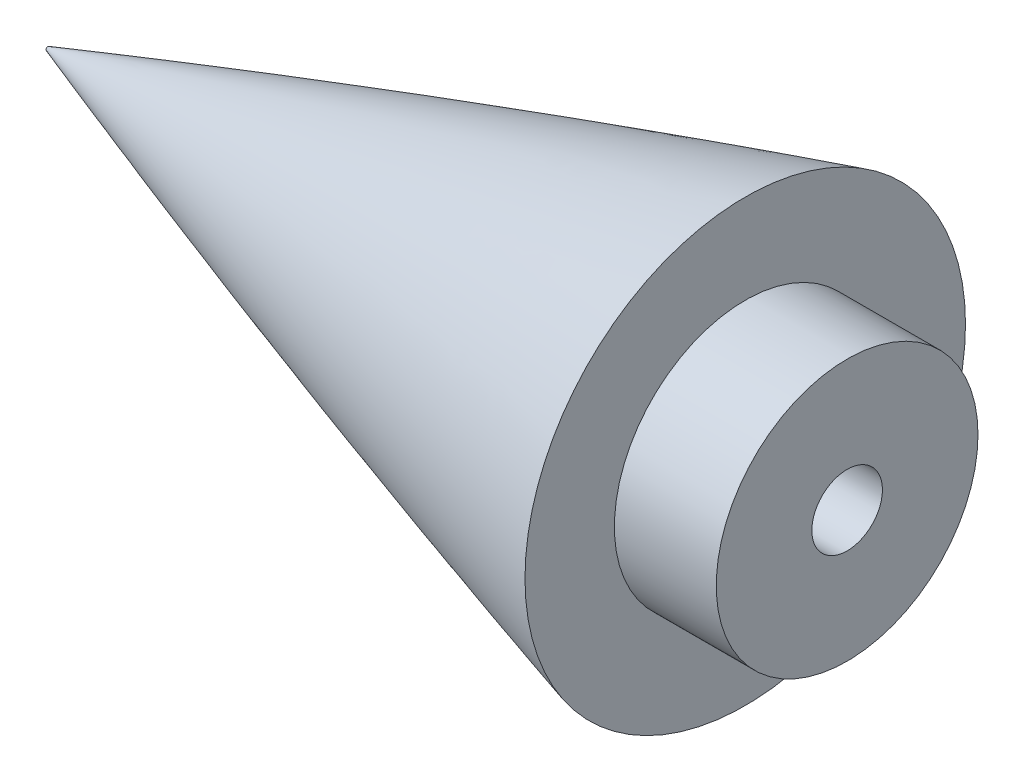
ISO-10303-21;
HEADER;
FILE_DESCRIPTION(('STEP AP214'),'2;1');
FILE_NAME('part.step','',(''),(''),'','','');
FILE_SCHEMA(('AUTOMOTIVE_DESIGN { 1 0 10303 214 1 1 1 1 }'));
ENDSEC;
DATA;
#1=APPLICATION_CONTEXT('core data for automotive mechanical design processes');
#2=APPLICATION_PROTOCOL_DEFINITION('international standard','automotive_design',2000,#1);
#3=PRODUCT_CONTEXT('',#1,'mechanical');
#4=PRODUCT('Part','Part','',(#3));
#5=PRODUCT_RELATED_PRODUCT_CATEGORY('part','',(#4));
#6=PRODUCT_DEFINITION_FORMATION('','',#4);
#7=PRODUCT_DEFINITION_CONTEXT('part definition',#1,'design');
#8=PRODUCT_DEFINITION('design','',#6,#7);
#9=PRODUCT_DEFINITION_SHAPE('','',#8);
#10=(LENGTH_UNIT() NAMED_UNIT(*) SI_UNIT(.MILLI.,.METRE.));
#11=(NAMED_UNIT(*) PLANE_ANGLE_UNIT() SI_UNIT($,.RADIAN.));
#12=(NAMED_UNIT(*) SI_UNIT($,.STERADIAN.) SOLID_ANGLE_UNIT());
#13=UNCERTAINTY_MEASURE_WITH_UNIT(LENGTH_MEASURE(1.E-05),#10,'distance_accuracy_value','');
#14=(GEOMETRIC_REPRESENTATION_CONTEXT(3) GLOBAL_UNCERTAINTY_ASSIGNED_CONTEXT((#13)) GLOBAL_UNIT_ASSIGNED_CONTEXT((#10,
#11,#12)) REPRESENTATION_CONTEXT('',''));
#15=CARTESIAN_POINT('',(0.,0.,0.));
#16=DIRECTION('',(0.,0.,1.));
#17=DIRECTION('',(1.,0.,0.));
#18=AXIS2_PLACEMENT_3D('',#15,#16,#17);
#19=CARTESIAN_POINT('',(304.799999999506,51.1047878336266,0.));
#20=CARTESIAN_POINT('',(270.933333332893,51.1047771241226,0.));
#21=CARTESIAN_POINT('',(237.06666666628,49.7240274145074,0.));
#22=CARTESIAN_POINT('',(203.199999999667,46.9624932596343,0.));
#23=CARTESIAN_POINT('',(169.333333333054,42.8097292504862,0.));
#24=CARTESIAN_POINT('',(135.46666666644,37.2447037749165,0.));
#25=CARTESIAN_POINT('',(101.599999999826,30.2351540671539,0.));
#26=CARTESIAN_POINT('',(67.7333333332116,21.7356981956307,0.));
#27=CARTESIAN_POINT('',(33.8666666665968,11.6851113039398,0.));
#28=CARTESIAN_POINT('',(-1.84184265061837E-11,-6.35667733728251E-12,0.));
#29=B_SPLINE_CURVE_WITH_KNOTS('',9,(#19,#20,#21,#22,#23,#24,#25,#26,#27,#28),.UNSPECIFIED.,.F.,
.F.,(10,10),(0.0799286240830465,0.916357147641747),.UNSPECIFIED.);
#30=CARTESIAN_POINT('',(0.,0.,0.));
#31=DIRECTION('',(-1.,0.,0.));
#32=AXIS1_PLACEMENT('',#30,#31);
#33=SURFACE_OF_REVOLUTION('',#29,#32);
#34=CARTESIAN_POINT('',(50.8,0.,0.));
#35=DIRECTION('',(-1.,0.,0.));
#36=DIRECTION('',(0.,0.,1.));
#37=AXIS2_PLACEMENT_3D('',#34,#35,#36);
#38=CIRCLE('',#37,15.9235143856326);
#39=CARTESIAN_POINT('',(50.8,0.,15.9235143856326));
#40=VERTEX_POINT('',#39);
#41=EDGE_CURVE('E53',#40,#40,#38,.T.);
#42=ORIENTED_EDGE('',*,*,#41,.T.);
#43=EDGE_LOOP('',(#42));
#44=FACE_BOUND('',#43,.T.);
#45=CARTESIAN_POINT('',(0.380999999999996,0.,0.));
#46=DIRECTION('',(-1.,0.,0.));
#47=DIRECTION('',(0.,0.,1.));
#48=AXIS2_PLACEMENT_3D('',#45,#46,#47);
#49=CIRCLE('',#48,0.131365573846303);
#50=CARTESIAN_POINT('',(0.380999999999996,0.,0.131365573846303));
#51=VERTEX_POINT('',#50);
#52=EDGE_CURVE('E78',#51,#51,#49,.F.);
#53=ORIENTED_EDGE('',*,*,#52,.T.);
#54=EDGE_LOOP('',(#53));
#55=FACE_BOUND('',#54,.T.);
#56=ADVANCED_FACE('F49',(#44,#55),#33,.T.);
#57=CARTESIAN_POINT('',(0.381,2.75984382523113,-51.1047878336267));
#58=DIRECTION('',(1.,0.,0.));
#59=DIRECTION('',(0.,1.,0.));
#60=AXIS2_PLACEMENT_3D('',#57,#58,#59);
#61=PLANE('',#60);
#62=ORIENTED_EDGE('',*,*,#52,.F.);
#63=EDGE_LOOP('',(#62));
#64=FACE_BOUND('',#63,.T.);
#65=ADVANCED_FACE('F100',(#64),#61,.F.);
#66=CARTESIAN_POINT('',(50.8,-63.5,-51.1047878336267));
#67=DIRECTION('',(-1.,0.,0.));
#68=DIRECTION('',(0.,0.,1.));
#69=AXIS2_PLACEMENT_3D('',#66,#67,#68);
#70=PLANE('',#69);
#71=CARTESIAN_POINT('',(50.8,0.,0.));
#72=DIRECTION('',(1.,0.,0.));
#73=DIRECTION('',(0.,0.,-1.));
#74=AXIS2_PLACEMENT_3D('',#71,#72,#73);
#75=CIRCLE('',#74,9.4615);
#76=CARTESIAN_POINT('',(50.8,0.,-9.4615));
#77=VERTEX_POINT('',#76);
#78=EDGE_CURVE('E11',#77,#77,#75,.T.);
#79=ORIENTED_EDGE('',*,*,#78,.F.);
#80=EDGE_LOOP('',(#79));
#81=FACE_BOUND('',#80,.T.);
#82=ORIENTED_EDGE('',*,*,#41,.F.);
#83=EDGE_LOOP('',(#82));
#84=FACE_BOUND('',#83,.T.);
#85=ADVANCED_FACE('F97',(#81,#84),#70,.F.);
#86=CARTESIAN_POINT('',(58.166,0.,0.));
#87=DIRECTION('',(-1.,0.,0.));
#88=DIRECTION('',(0.,0.,1.));
#89=AXIS2_PLACEMENT_3D('',#86,#87,#88);
#90=CYLINDRICAL_SURFACE('',#89,9.4615);
#91=CARTESIAN_POINT('',(58.166,0.,0.));
#92=DIRECTION('',(1.,0.,0.));
#93=DIRECTION('',(0.,0.,-1.));
#94=AXIS2_PLACEMENT_3D('',#91,#92,#93);
#95=CIRCLE('',#94,9.4615);
#96=CARTESIAN_POINT('',(58.166,0.,-9.4615));
#97=VERTEX_POINT('',#96);
#98=EDGE_CURVE('E72',#97,#97,#95,.T.);
#99=ORIENTED_EDGE('',*,*,#98,.F.);
#100=EDGE_LOOP('',(#99));
#101=FACE_BOUND('',#100,.T.);
#102=ORIENTED_EDGE('',*,*,#78,.T.);
#103=EDGE_LOOP('',(#102));
#104=FACE_BOUND('',#103,.T.);
#105=ADVANCED_FACE('F99',(#101,#104),#90,.T.);
#106=CARTESIAN_POINT('',(58.166,0.,0.));
#107=DIRECTION('',(1.,0.,0.));
#108=DIRECTION('',(0.,0.,-1.));
#109=AXIS2_PLACEMENT_3D('',#106,#107,#108);
#110=PLANE('',#109);
#111=CARTESIAN_POINT('',(58.166,0.,0.));
#112=DIRECTION('',(1.,0.,0.));
#113=DIRECTION('',(0.,0.,-1.));
#114=AXIS2_PLACEMENT_3D('',#111,#112,#113);
#115=CIRCLE('',#114,2.55269999999999);
#116=CARTESIAN_POINT('',(58.166,0.,-2.55269999999999));
#117=VERTEX_POINT('',#116);
#118=EDGE_CURVE('E73',#117,#117,#115,.T.);
#119=ORIENTED_EDGE('',*,*,#118,.F.);
#120=EDGE_LOOP('',(#119));
#121=FACE_BOUND('',#120,.T.);
#122=ORIENTED_EDGE('',*,*,#98,.T.);
#123=EDGE_LOOP('',(#122));
#124=FACE_BOUND('',#123,.T.);
#125=ADVANCED_FACE('F65',(#121,#124),#110,.T.);
#126=CARTESIAN_POINT('',(32.766,0.,0.));
#127=DIRECTION('',(1.,0.,0.));
#128=DIRECTION('',(0.,0.,-1.));
#129=AXIS2_PLACEMENT_3D('',#126,#127,#128);
#130=CONICAL_SURFACE('',#129,2.55269999999999,1.02974425867665);
#131=CARTESIAN_POINT('',(31.2321830978083,0.,0.));
#132=VERTEX_POINT('',#131);
#133=VERTEX_LOOP('',#132);
#134=FACE_BOUND('',#133,.T.);
#135=CARTESIAN_POINT('',(32.766,0.,0.));
#136=DIRECTION('',(1.,0.,0.));
#137=DIRECTION('',(0.,0.,-1.));
#138=AXIS2_PLACEMENT_3D('',#135,#136,#137);
#139=CIRCLE('',#138,2.55269999999999);
#140=CARTESIAN_POINT('',(32.766,0.,-2.55269999999999));
#141=VERTEX_POINT('',#140);
#142=EDGE_CURVE('E69',#141,#141,#139,.T.);
#143=ORIENTED_EDGE('',*,*,#142,.T.);
#144=EDGE_LOOP('',(#143));
#145=FACE_BOUND('',#144,.T.);
#146=ADVANCED_FACE('F61',(#134,#145),#130,.F.);
#147=CARTESIAN_POINT('',(58.166,0.,0.));
#148=DIRECTION('',(1.,0.,0.));
#149=DIRECTION('',(0.,0.,-1.));
#150=AXIS2_PLACEMENT_3D('',#147,#148,#149);
#151=CYLINDRICAL_SURFACE('',#150,2.55269999999999);
#152=ORIENTED_EDGE('',*,*,#142,.F.);
#153=EDGE_LOOP('',(#152));
#154=FACE_BOUND('',#153,.T.);
#155=ORIENTED_EDGE('',*,*,#118,.T.);
#156=EDGE_LOOP('',(#155));
#157=FACE_BOUND('',#156,.T.);
#158=ADVANCED_FACE('F64',(#154,#157),#151,.F.);
#159=CLOSED_SHELL('',(#56,#65,#85,#105,#125,#146,#158));
#160=MANIFOLD_SOLID_BREP('B2',#159);
#161=ADVANCED_BREP_SHAPE_REPRESENTATION('',(#18,#160),#14);
#162=SHAPE_DEFINITION_REPRESENTATION(#9,#161);
ENDSEC;
END-ISO-10303-21;
